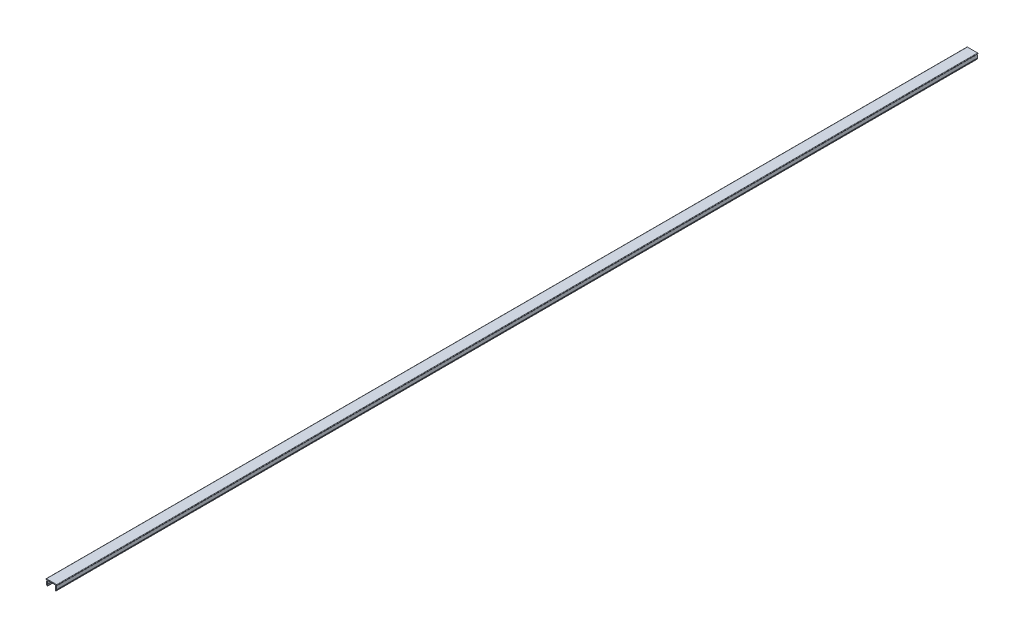
ISO-10303-21;
HEADER;
FILE_DESCRIPTION(('STEP AP214'),'2;1');
FILE_NAME('part.step','',(''),(''),'','','');
FILE_SCHEMA(('AUTOMOTIVE_DESIGN { 1 0 10303 214 1 1 1 1 }'));
ENDSEC;
DATA;
#1=APPLICATION_CONTEXT('core data for automotive mechanical design processes');
#2=APPLICATION_PROTOCOL_DEFINITION('international standard','automotive_design',2000,#1);
#3=PRODUCT_CONTEXT('',#1,'mechanical');
#4=PRODUCT('Part','Part','',(#3));
#5=PRODUCT_RELATED_PRODUCT_CATEGORY('part','',(#4));
#6=PRODUCT_DEFINITION_FORMATION('','',#4);
#7=PRODUCT_DEFINITION_CONTEXT('part definition',#1,'design');
#8=PRODUCT_DEFINITION('design','',#6,#7);
#9=PRODUCT_DEFINITION_SHAPE('','',#8);
#10=(LENGTH_UNIT() NAMED_UNIT(*) SI_UNIT(.MILLI.,.METRE.));
#11=(NAMED_UNIT(*) PLANE_ANGLE_UNIT() SI_UNIT($,.RADIAN.));
#12=(NAMED_UNIT(*) SI_UNIT($,.STERADIAN.) SOLID_ANGLE_UNIT());
#13=UNCERTAINTY_MEASURE_WITH_UNIT(LENGTH_MEASURE(1.E-05),#10,'distance_accuracy_value','');
#14=(GEOMETRIC_REPRESENTATION_CONTEXT(3) GLOBAL_UNCERTAINTY_ASSIGNED_CONTEXT((#13)) GLOBAL_UNIT_ASSIGNED_CONTEXT((#10,
#11,#12)) REPRESENTATION_CONTEXT('',''));
#15=CARTESIAN_POINT('',(0.,0.,0.));
#16=DIRECTION('',(0.,0.,1.));
#17=DIRECTION('',(1.,0.,0.));
#18=AXIS2_PLACEMENT_3D('',#15,#16,#17);
#19=CARTESIAN_POINT('',(-6.32090219434622,1.08946697437392,501.445672972466));
#20=DIRECTION('',(0.,1.,0.));
#21=DIRECTION('',(-1.,0.,0.));
#22=AXIS2_PLACEMENT_3D('',#19,#20,#21);
#23=PLANE('',#22);
#24=DIRECTION('',(1.,0.,0.));
#25=VECTOR('',#24,1.);
#26=CARTESIAN_POINT('',(-6.32090219434622,1.08946697437392,-498.554327027534));
#27=LINE('',#26,#25);
#28=CARTESIAN_POINT('',(-3.93044355146653,1.08946697437392,-498.554327027534));
#29=VERTEX_POINT('',#28);
#30=CARTESIAN_POINT('',(3.28863916277409,1.08946697437393,-498.554327027534));
#31=VERTEX_POINT('',#30);
#32=EDGE_CURVE('E202',#29,#31,#27,.T.);
#33=ORIENTED_EDGE('',*,*,#32,.T.);
#34=DIRECTION('',(0.,0.,-1.));
#35=VECTOR('',#34,1.);
#36=CARTESIAN_POINT('',(3.28863916277409,1.08946697437393,501.445672972466));
#37=LINE('',#36,#35);
#38=CARTESIAN_POINT('',(3.28863916277409,1.08946697437393,501.445672972466));
#39=VERTEX_POINT('',#38);
#40=EDGE_CURVE('E244',#31,#39,#37,.F.);
#41=ORIENTED_EDGE('',*,*,#40,.T.);
#42=DIRECTION('',(1.,0.,0.));
#43=VECTOR('',#42,1.);
#44=CARTESIAN_POINT('',(-6.32090219434622,1.08946697437392,501.445672972466));
#45=LINE('',#44,#43);
#46=CARTESIAN_POINT('',(-3.93044355146653,1.08946697437392,501.445672972466));
#47=VERTEX_POINT('',#46);
#48=EDGE_CURVE('E231',#47,#39,#45,.T.);
#49=ORIENTED_EDGE('',*,*,#48,.F.);
#50=DIRECTION('',(0.,0.,-1.));
#51=VECTOR('',#50,1.);
#52=CARTESIAN_POINT('',(-3.93044355146653,1.08946697437392,501.445672972466));
#53=LINE('',#52,#51);
#54=EDGE_CURVE('E241',#47,#29,#53,.T.);
#55=ORIENTED_EDGE('',*,*,#54,.T.);
#56=EDGE_LOOP('',(#33,#41,#49,#55));
#57=FACE_BOUND('',#56,.T.);
#58=ADVANCED_FACE('F15',(#57),#23,.F.);
#59=CARTESIAN_POINT('',(-5.82090219434622,1.08946697437392,501.445672972466));
#60=VERTEX_POINT('',#59);
#61=CARTESIAN_POINT('',(-5.38241058555351,1.08946697437392,501.445672972466));
#62=VERTEX_POINT('',#61);
#63=EDGE_CURVE('E229',#60,#62,#45,.T.);
#64=ORIENTED_EDGE('',*,*,#63,.F.);
#65=DIRECTION('',(0.,0.,-1.));
#66=VECTOR('',#65,1.);
#67=CARTESIAN_POINT('',(-5.82090219434622,1.08946697437392,-498.554327027534));
#68=LINE('',#67,#66);
#69=CARTESIAN_POINT('',(-5.82090219434622,1.08946697437392,-498.554327027534));
#70=VERTEX_POINT('',#69);
#71=EDGE_CURVE('E197',#60,#70,#68,.T.);
#72=ORIENTED_EDGE('',*,*,#71,.T.);
#73=CARTESIAN_POINT('',(-5.38241058555351,1.08946697437392,-498.554327027534));
#74=VERTEX_POINT('',#73);
#75=EDGE_CURVE('E190',#70,#74,#27,.T.);
#76=ORIENTED_EDGE('',*,*,#75,.T.);
#77=DIRECTION('',(0.,0.,-1.));
#78=VECTOR('',#77,1.);
#79=CARTESIAN_POINT('',(-5.38241058555351,1.08946697437392,501.445672972466));
#80=LINE('',#79,#78);
#81=EDGE_CURVE('E194',#62,#74,#80,.T.);
#82=ORIENTED_EDGE('',*,*,#81,.F.);
#83=EDGE_LOOP('',(#64,#72,#76,#82));
#84=FACE_BOUND('',#83,.T.);
#85=ADVANCED_FACE('F193',(#84),#23,.F.);
#86=CARTESIAN_POINT('',(4.74060619686107,1.08946697437393,-498.554327027534));
#87=VERTEX_POINT('',#86);
#88=CARTESIAN_POINT('',(5.17909780565378,1.08946697437393,-498.554327027534));
#89=VERTEX_POINT('',#88);
#90=EDGE_CURVE('E204',#87,#89,#27,.T.);
#91=ORIENTED_EDGE('',*,*,#90,.T.);
#92=DIRECTION('',(0.,0.,-1.));
#93=VECTOR('',#92,1.);
#94=CARTESIAN_POINT('',(5.17909780565378,1.08946697437393,501.445672972466));
#95=LINE('',#94,#93);
#96=CARTESIAN_POINT('',(5.17909780565378,1.08946697437393,501.445672972466));
#97=VERTEX_POINT('',#96);
#98=EDGE_CURVE('E319',#89,#97,#95,.F.);
#99=ORIENTED_EDGE('',*,*,#98,.T.);
#100=CARTESIAN_POINT('',(4.74060619686107,1.08946697437393,501.445672972466));
#101=VERTEX_POINT('',#100);
#102=EDGE_CURVE('E232',#101,#97,#45,.T.);
#103=ORIENTED_EDGE('',*,*,#102,.F.);
#104=DIRECTION('',(0.,0.,-1.));
#105=VECTOR('',#104,1.);
#106=CARTESIAN_POINT('',(4.74060619686107,1.08946697437393,501.445672972466));
#107=LINE('',#106,#105);
#108=EDGE_CURVE('E409',#101,#87,#107,.T.);
#109=ORIENTED_EDGE('',*,*,#108,.T.);
#110=EDGE_LOOP('',(#91,#99,#103,#109));
#111=FACE_BOUND('',#110,.T.);
#112=ADVANCED_FACE('F370',(#111),#23,.F.);
#113=CARTESIAN_POINT('',(-6.32090219434622,2.08946697437392,501.445672972466));
#114=DIRECTION('',(0.,1.,0.));
#115=DIRECTION('',(-1.,0.,0.));
#116=AXIS2_PLACEMENT_3D('',#113,#114,#115);
#117=PLANE('',#116);
#118=DIRECTION('',(1.,0.,0.));
#119=VECTOR('',#118,1.);
#120=CARTESIAN_POINT('',(-6.32090219434622,2.08946697437392,501.445672972466));
#121=LINE('',#120,#119);
#122=CARTESIAN_POINT('',(-5.82090219434622,2.08946697437392,501.445672972466));
#123=VERTEX_POINT('',#122);
#124=CARTESIAN_POINT('',(5.17909780565378,2.08946697437393,501.445672972466));
#125=VERTEX_POINT('',#124);
#126=EDGE_CURVE('E213',#123,#125,#121,.T.);
#127=ORIENTED_EDGE('',*,*,#126,.T.);
#128=DIRECTION('',(0.,0.,-1.));
#129=VECTOR('',#128,1.);
#130=CARTESIAN_POINT('',(5.17909780565378,2.08946697437393,501.445672972466));
#131=LINE('',#130,#129);
#132=CARTESIAN_POINT('',(5.17909780565378,2.08946697437393,-498.554327027534));
#133=VERTEX_POINT('',#132);
#134=EDGE_CURVE('E316',#125,#133,#131,.T.);
#135=ORIENTED_EDGE('',*,*,#134,.T.);
#136=DIRECTION('',(1.,0.,0.));
#137=VECTOR('',#136,1.);
#138=CARTESIAN_POINT('',(-6.32090219434622,2.08946697437392,-498.554327027534));
#139=LINE('',#138,#137);
#140=CARTESIAN_POINT('',(-5.82090219434622,2.08946697437392,-498.554327027534));
#141=VERTEX_POINT('',#140);
#142=EDGE_CURVE('E201',#141,#133,#139,.T.);
#143=ORIENTED_EDGE('',*,*,#142,.F.);
#144=DIRECTION('',(0.,0.,-1.));
#145=VECTOR('',#144,1.);
#146=CARTESIAN_POINT('',(-5.82090219434622,2.08946697437392,501.445672972466));
#147=LINE('',#146,#145);
#148=EDGE_CURVE('E313',#141,#123,#147,.F.);
#149=ORIENTED_EDGE('',*,*,#148,.T.);
#150=EDGE_LOOP('',(#127,#135,#143,#149));
#151=FACE_BOUND('',#150,.T.);
#152=ADVANCED_FACE('F358',(#151),#117,.T.);
#153=CARTESIAN_POINT('',(-4.19256356916025,-4.56053287042964,501.445672972466));
#154=DIRECTION('',(0.,0.,-1.));
#155=DIRECTION('',(-1.,0.,0.));
#156=AXIS2_PLACEMENT_3D('',#153,#154,#155);
#157=PLANE('',#156);
#158=DIRECTION('',(0.334719806751246,-0.942317701716575,0.));
#159=VECTOR('',#158,1.);
#160=CARTESIAN_POINT('',(-5.7920610452045,-2.8778929290017,501.445672972466));
#161=LINE('',#160,#159);
#162=CARTESIAN_POINT('',(-5.7920610452045,-2.8778929290017,501.445672972466));
#163=VERTEX_POINT('',#162);
#164=CARTESIAN_POINT('',(-5.39108641572947,-4.00673407814341,501.445672972466));
#165=VERTEX_POINT('',#164);
#166=EDGE_CURVE('E218',#163,#165,#161,.T.);
#167=ORIENTED_EDGE('',*,*,#166,.T.);
#168=CARTESIAN_POINT('',(-4.91992756487118,-3.83937417476779,501.445672972466));
#169=DIRECTION('',(0.,0.,-1.));
#170=DIRECTION('',(-1.,0.,0.));
#171=AXIS2_PLACEMENT_3D('',#168,#169,#170);
#172=CIRCLE('',#171,0.5);
#173=CARTESIAN_POINT('',(-4.75256766149556,-4.31053302562608,501.445672972466));
#174=VERTEX_POINT('',#173);
#175=EDGE_CURVE('E293',#165,#174,#172,.F.);
#176=ORIENTED_EDGE('',*,*,#175,.T.);
#177=CARTESIAN_POINT('',(-4.91992756487118,-3.83937417476779,501.445672972466));
#178=DIRECTION('',(0.,0.,-1.));
#179=DIRECTION('',(-1.,0.,0.));
#180=AXIS2_PLACEMENT_3D('',#177,#178,#179);
#181=CIRCLE('',#180,0.5);
#182=CARTESIAN_POINT('',(-4.4487687140129,-3.67201427139217,501.445672972466));
#183=VERTEX_POINT('',#182);
#184=EDGE_CURVE('E32',#174,#183,#181,.F.);
#185=ORIENTED_EDGE('',*,*,#184,.T.);
#186=DIRECTION('',(0.334719806751246,-0.942317701716575,0.));
#187=VECTOR('',#186,1.);
#188=CARTESIAN_POINT('',(-4.84974334348793,-2.54317312225045,501.445672972466));
#189=LINE('',#188,#187);
#190=CARTESIAN_POINT('',(-4.77188850715656,-2.76235343055475,501.445672972466));
#191=VERTEX_POINT('',#190);
#192=EDGE_CURVE('E222',#191,#183,#189,.T.);
#193=ORIENTED_EDGE('',*,*,#192,.F.);
#194=CARTESIAN_POINT('',(-4.30072965629827,-2.59499352717913,501.445672972466));
#195=DIRECTION('',(0.,0.,-1.));
#196=DIRECTION('',(-1.,0.,0.));
#197=AXIS2_PLACEMENT_3D('',#194,#195,#196);
#198=CIRCLE('',#197,0.5);
#199=CARTESIAN_POINT('',(-4.7973833464489,-2.53724309809185,501.445672972466));
#200=VERTEX_POINT('',#199);
#201=EDGE_CURVE('E9',#191,#200,#198,.T.);
#202=ORIENTED_EDGE('',*,*,#201,.T.);
#203=DIRECTION('',(-0.115500858174564,-0.993307380301254,0.));
#204=VECTOR('',#203,1.);
#205=CARTESIAN_POINT('',(-4.32424850419559,1.53171654528664,501.445672972466));
#206=LINE('',#205,#204);
#207=CARTESIAN_POINT('',(-4.42709724161715,0.647217403461206,501.445672972466));
#208=VERTEX_POINT('',#207);
#209=EDGE_CURVE('E413',#208,#200,#206,.T.);
#210=ORIENTED_EDGE('',*,*,#209,.F.);
#211=CARTESIAN_POINT('',(-3.93044355146653,0.589466974373924,501.445672972466));
#212=DIRECTION('',(0.,0.,-1.));
#213=DIRECTION('',(-1.,0.,0.));
#214=AXIS2_PLACEMENT_3D('',#211,#212,#213);
#215=CIRCLE('',#214,0.5);
#216=EDGE_CURVE('E328',#208,#47,#215,.T.);
#217=ORIENTED_EDGE('',*,*,#216,.T.);
#218=ORIENTED_EDGE('',*,*,#48,.T.);
#219=CARTESIAN_POINT('',(3.28863916277409,0.589466974373926,501.445672972466));
#220=DIRECTION('',(0.,0.,-1.));
#221=DIRECTION('',(-1.,0.,0.));
#222=AXIS2_PLACEMENT_3D('',#219,#220,#221);
#223=CIRCLE('',#222,0.5);
#224=CARTESIAN_POINT('',(3.78529285292472,0.647217403461207,501.445672972466));
#225=VERTEX_POINT('',#224);
#226=EDGE_CURVE('E324',#39,#225,#223,.T.);
#227=ORIENTED_EDGE('',*,*,#226,.T.);
#228=DIRECTION('',(0.115500858174564,-0.993307380301254,0.));
#229=VECTOR('',#228,1.);
#230=CARTESIAN_POINT('',(3.68244411550316,1.53171654528664,501.445672972466));
#231=LINE('',#230,#229);
#232=CARTESIAN_POINT('',(4.15557895775647,-2.53724309809185,501.445672972466));
#233=VERTEX_POINT('',#232);
#234=EDGE_CURVE('E394',#225,#233,#231,.T.);
#235=ORIENTED_EDGE('',*,*,#234,.T.);
#236=CARTESIAN_POINT('',(3.65892526760584,-2.59499352717913,501.445672972466));
#237=DIRECTION('',(0.,0.,-1.));
#238=DIRECTION('',(-1.,0.,0.));
#239=AXIS2_PLACEMENT_3D('',#236,#237,#238);
#240=CIRCLE('',#239,0.5);
#241=CARTESIAN_POINT('',(4.13008411846413,-2.76235343055475,501.445672972466));
#242=VERTEX_POINT('',#241);
#243=EDGE_CURVE('E332',#233,#242,#240,.T.);
#244=ORIENTED_EDGE('',*,*,#243,.T.);
#245=DIRECTION('',(-0.334719806751245,-0.942317701716576,0.));
#246=VECTOR('',#245,1.);
#247=CARTESIAN_POINT('',(4.2079389547955,-2.54317312225045,501.445672972466));
#248=LINE('',#247,#246);
#249=CARTESIAN_POINT('',(3.80696432532046,-3.67201427139216,501.445672972466));
#250=VERTEX_POINT('',#249);
#251=EDGE_CURVE('E398',#242,#250,#248,.T.);
#252=ORIENTED_EDGE('',*,*,#251,.T.);
#253=CARTESIAN_POINT('',(4.27812317617875,-3.83937417476779,501.445672972466));
#254=DIRECTION('',(0.,0.,-1.));
#255=DIRECTION('',(-1.,0.,0.));
#256=AXIS2_PLACEMENT_3D('',#253,#254,#255);
#257=CIRCLE('',#256,0.5);
#258=CARTESIAN_POINT('',(4.11076327280313,-4.31053302562608,501.445672972466));
#259=VERTEX_POINT('',#258);
#260=EDGE_CURVE('E288',#250,#259,#257,.F.);
#261=ORIENTED_EDGE('',*,*,#260,.T.);
#262=CARTESIAN_POINT('',(4.27812317617875,-3.83937417476779,501.445672972466));
#263=DIRECTION('',(0.,0.,-1.));
#264=DIRECTION('',(-1.,0.,0.));
#265=AXIS2_PLACEMENT_3D('',#262,#263,#264);
#266=CIRCLE('',#265,0.5);
#267=CARTESIAN_POINT('',(4.74928202703704,-4.00673407814341,501.445672972466));
#268=VERTEX_POINT('',#267);
#269=EDGE_CURVE('E290',#259,#268,#266,.F.);
#270=ORIENTED_EDGE('',*,*,#269,.T.);
#271=DIRECTION('',(-0.334719806751245,-0.942317701716576,0.));
#272=VECTOR('',#271,1.);
#273=CARTESIAN_POINT('',(5.15025665651207,-2.8778929290017,501.445672972466));
#274=LINE('',#273,#272);
#275=CARTESIAN_POINT('',(5.15025665651207,-2.8778929290017,501.445672972466));
#276=VERTEX_POINT('',#275);
#277=EDGE_CURVE('E402',#276,#268,#274,.T.);
#278=ORIENTED_EDGE('',*,*,#277,.F.);
#279=CARTESIAN_POINT('',(4.67909780565378,-2.71053302562608,501.445672972466));
#280=DIRECTION('',(0.,0.,-1.));
#281=DIRECTION('',(-1.,0.,0.));
#282=AXIS2_PLACEMENT_3D('',#279,#280,#281);
#283=CIRCLE('',#282,0.5);
#284=CARTESIAN_POINT('',(5.17575149580441,-2.65278259653879,501.445672972466));
#285=VERTEX_POINT('',#284);
#286=EDGE_CURVE('E284',#276,#285,#283,.F.);
#287=ORIENTED_EDGE('',*,*,#286,.T.);
#288=DIRECTION('',(0.115500858174564,-0.993307380301254,0.));
#289=VECTOR('',#288,1.);
#290=CARTESIAN_POINT('',(4.67575149580441,1.64721740346121,501.445672972466));
#291=LINE('',#290,#289);
#292=EDGE_CURVE('E374',#101,#285,#291,.T.);
#293=ORIENTED_EDGE('',*,*,#292,.F.);
#294=ORIENTED_EDGE('',*,*,#102,.T.);
#295=CARTESIAN_POINT('',(5.17909780565378,1.58946697437393,501.445672972466));
#296=DIRECTION('',(0.,0.,-1.));
#297=DIRECTION('',(-1.,0.,0.));
#298=AXIS2_PLACEMENT_3D('',#295,#296,#297);
#299=CIRCLE('',#298,0.5);
#300=CARTESIAN_POINT('',(5.67909780565378,1.58946697437393,501.445672972466));
#301=VERTEX_POINT('',#300);
#302=EDGE_CURVE('E280',#97,#301,#299,.F.);
#303=ORIENTED_EDGE('',*,*,#302,.T.);
#304=CARTESIAN_POINT('',(5.17909780565378,1.58946697437392,501.445672972466));
#305=DIRECTION('',(0.,0.,-1.));
#306=DIRECTION('',(-1.,0.,0.));
#307=AXIS2_PLACEMENT_3D('',#304,#305,#306);
#308=CIRCLE('',#307,0.5);
#309=EDGE_CURVE('E282',#301,#125,#308,.F.);
#310=ORIENTED_EDGE('',*,*,#309,.T.);
#311=ORIENTED_EDGE('',*,*,#126,.F.);
#312=CARTESIAN_POINT('',(-5.82090219434622,1.58946697437392,501.445672972466));
#313=DIRECTION('',(0.,0.,-1.));
#314=DIRECTION('',(-1.,0.,0.));
#315=AXIS2_PLACEMENT_3D('',#312,#313,#314);
#316=CIRCLE('',#315,0.5);
#317=CARTESIAN_POINT('',(-6.32090219434622,1.58946697437392,501.445672972466));
#318=VERTEX_POINT('',#317);
#319=EDGE_CURVE('E278',#123,#318,#316,.F.);
#320=ORIENTED_EDGE('',*,*,#319,.T.);
#321=CARTESIAN_POINT('',(-5.82090219434622,1.58946697437392,501.445672972466));
#322=DIRECTION('',(0.,0.,-1.));
#323=DIRECTION('',(-1.,0.,0.));
#324=AXIS2_PLACEMENT_3D('',#321,#322,#323);
#325=CIRCLE('',#324,0.5);
#326=EDGE_CURVE('E276',#318,#60,#325,.F.);
#327=ORIENTED_EDGE('',*,*,#326,.T.);
#328=ORIENTED_EDGE('',*,*,#63,.T.);
#329=DIRECTION('',(-0.115500858174564,-0.993307380301254,0.));
#330=VECTOR('',#329,1.);
#331=CARTESIAN_POINT('',(-5.31755588449685,1.6472174034612,501.445672972466));
#332=LINE('',#331,#330);
#333=CARTESIAN_POINT('',(-5.81755588449684,-2.6527825965388,501.445672972466));
#334=VERTEX_POINT('',#333);
#335=EDGE_CURVE('E211',#62,#334,#332,.T.);
#336=ORIENTED_EDGE('',*,*,#335,.T.);
#337=CARTESIAN_POINT('',(-5.32090219434622,-2.71053302562608,501.445672972466));
#338=DIRECTION('',(0.,0.,-1.));
#339=DIRECTION('',(-1.,0.,0.));
#340=AXIS2_PLACEMENT_3D('',#337,#338,#339);
#341=CIRCLE('',#340,0.5);
#342=EDGE_CURVE('E286',#334,#163,#341,.F.);
#343=ORIENTED_EDGE('',*,*,#342,.T.);
#344=EDGE_LOOP('',(#167,#176,#185,#193,#202,#210,#217,#218,#227,#235,#244,#252,#261,#270,#278,
#287,#293,#294,#303,#310,#311,#320,#327,#328,#336,#343));
#345=FACE_BOUND('',#344,.T.);
#346=ADVANCED_FACE('F354',(#345),#157,.F.);
#347=CARTESIAN_POINT('',(-4.19256356916025,-4.56053287042964,-498.554327027534));
#348=DIRECTION('',(0.,0.,-1.));
#349=DIRECTION('',(-1.,0.,0.));
#350=AXIS2_PLACEMENT_3D('',#347,#348,#349);
#351=PLANE('',#350);
#352=CARTESIAN_POINT('',(-4.91992756487118,-3.83937417476779,-498.554327027534));
#353=DIRECTION('',(0.,0.,-1.));
#354=DIRECTION('',(-1.,0.,0.));
#355=AXIS2_PLACEMENT_3D('',#352,#353,#354);
#356=CIRCLE('',#355,0.5);
#357=CARTESIAN_POINT('',(-4.4487687140129,-3.67201427139217,-498.554327027534));
#358=VERTEX_POINT('',#357);
#359=CARTESIAN_POINT('',(-4.75256766149556,-4.31053302562608,-498.554327027534));
#360=VERTEX_POINT('',#359);
#361=EDGE_CURVE('E266',#358,#360,#356,.T.);
#362=ORIENTED_EDGE('',*,*,#361,.T.);
#363=CARTESIAN_POINT('',(-4.91992756487118,-3.83937417476779,-498.554327027534));
#364=DIRECTION('',(0.,0.,-1.));
#365=DIRECTION('',(-1.,0.,0.));
#366=AXIS2_PLACEMENT_3D('',#363,#364,#365);
#367=CIRCLE('',#366,0.5);
#368=CARTESIAN_POINT('',(-5.39108641572947,-4.00673407814341,-498.554327027534));
#369=VERTEX_POINT('',#368);
#370=EDGE_CURVE('E268',#360,#369,#367,.T.);
#371=ORIENTED_EDGE('',*,*,#370,.T.);
#372=DIRECTION('',(0.334719806751246,-0.942317701716575,0.));
#373=VECTOR('',#372,1.);
#374=CARTESIAN_POINT('',(-5.7920610452045,-2.8778929290017,-498.554327027534));
#375=LINE('',#374,#373);
#376=CARTESIAN_POINT('',(-5.7920610452045,-2.8778929290017,-498.554327027534));
#377=VERTEX_POINT('',#376);
#378=EDGE_CURVE('E410',#377,#369,#375,.T.);
#379=ORIENTED_EDGE('',*,*,#378,.F.);
#380=CARTESIAN_POINT('',(-5.32090219434622,-2.71053302562608,-498.554327027534));
#381=DIRECTION('',(0.,0.,-1.));
#382=DIRECTION('',(-1.,0.,0.));
#383=AXIS2_PLACEMENT_3D('',#380,#381,#382);
#384=CIRCLE('',#383,0.5);
#385=CARTESIAN_POINT('',(-5.81755588449684,-2.6527825965388,-498.554327027534));
#386=VERTEX_POINT('',#385);
#387=EDGE_CURVE('E217',#377,#386,#384,.T.);
#388=ORIENTED_EDGE('',*,*,#387,.T.);
#389=DIRECTION('',(-0.115500858174564,-0.993307380301254,0.));
#390=VECTOR('',#389,1.);
#391=CARTESIAN_POINT('',(-5.31755588449685,1.6472174034612,-498.554327027534));
#392=LINE('',#391,#390);
#393=EDGE_CURVE('E208',#74,#386,#392,.T.);
#394=ORIENTED_EDGE('',*,*,#393,.F.);
#395=ORIENTED_EDGE('',*,*,#75,.F.);
#396=CARTESIAN_POINT('',(-5.82090219434622,1.58946697437392,-498.554327027534));
#397=DIRECTION('',(0.,0.,-1.));
#398=DIRECTION('',(-1.,0.,0.));
#399=AXIS2_PLACEMENT_3D('',#396,#397,#398);
#400=CIRCLE('',#399,0.5);
#401=CARTESIAN_POINT('',(-6.32090219434622,1.58946697437392,-498.554327027534));
#402=VERTEX_POINT('',#401);
#403=EDGE_CURVE('E251',#70,#402,#400,.T.);
#404=ORIENTED_EDGE('',*,*,#403,.T.);
#405=CARTESIAN_POINT('',(-5.82090219434622,1.58946697437392,-498.554327027534));
#406=DIRECTION('',(0.,0.,-1.));
#407=DIRECTION('',(-1.,0.,0.));
#408=AXIS2_PLACEMENT_3D('',#405,#406,#407);
#409=CIRCLE('',#408,0.5);
#410=EDGE_CURVE('E253',#402,#141,#409,.T.);
#411=ORIENTED_EDGE('',*,*,#410,.T.);
#412=ORIENTED_EDGE('',*,*,#142,.T.);
#413=CARTESIAN_POINT('',(5.17909780565378,1.58946697437392,-498.554327027534));
#414=DIRECTION('',(0.,0.,-1.));
#415=DIRECTION('',(-1.,0.,0.));
#416=AXIS2_PLACEMENT_3D('',#413,#414,#415);
#417=CIRCLE('',#416,0.5);
#418=CARTESIAN_POINT('',(5.67909780565378,1.58946697437393,-498.554327027534));
#419=VERTEX_POINT('',#418);
#420=EDGE_CURVE('E257',#133,#419,#417,.T.);
#421=ORIENTED_EDGE('',*,*,#420,.T.);
#422=CARTESIAN_POINT('',(5.17909780565378,1.58946697437393,-498.554327027534));
#423=DIRECTION('',(0.,0.,-1.));
#424=DIRECTION('',(-1.,0.,0.));
#425=AXIS2_PLACEMENT_3D('',#422,#423,#424);
#426=CIRCLE('',#425,0.5);
#427=EDGE_CURVE('E255',#419,#89,#426,.T.);
#428=ORIENTED_EDGE('',*,*,#427,.T.);
#429=ORIENTED_EDGE('',*,*,#90,.F.);
#430=DIRECTION('',(0.115500858174564,-0.993307380301254,0.));
#431=VECTOR('',#430,1.);
#432=CARTESIAN_POINT('',(4.67575149580441,1.64721740346121,-498.554327027534));
#433=LINE('',#432,#431);
#434=CARTESIAN_POINT('',(5.17575149580441,-2.65278259653879,-498.554327027534));
#435=VERTEX_POINT('',#434);
#436=EDGE_CURVE('E399',#87,#435,#433,.T.);
#437=ORIENTED_EDGE('',*,*,#436,.T.);
#438=CARTESIAN_POINT('',(4.67909780565378,-2.71053302562608,-498.554327027534));
#439=DIRECTION('',(0.,0.,-1.));
#440=DIRECTION('',(-1.,0.,0.));
#441=AXIS2_PLACEMENT_3D('',#438,#439,#440);
#442=CIRCLE('',#441,0.5);
#443=CARTESIAN_POINT('',(5.15025665651207,-2.8778929290017,-498.554327027534));
#444=VERTEX_POINT('',#443);
#445=EDGE_CURVE('E259',#435,#444,#442,.T.);
#446=ORIENTED_EDGE('',*,*,#445,.T.);
#447=DIRECTION('',(-0.334719806751245,-0.942317701716576,0.));
#448=VECTOR('',#447,1.);
#449=CARTESIAN_POINT('',(5.15025665651207,-2.8778929290017,-498.554327027534));
#450=LINE('',#449,#448);
#451=CARTESIAN_POINT('',(4.74928202703704,-4.00673407814341,-498.554327027534));
#452=VERTEX_POINT('',#451);
#453=EDGE_CURVE('E405',#444,#452,#450,.T.);
#454=ORIENTED_EDGE('',*,*,#453,.T.);
#455=CARTESIAN_POINT('',(4.27812317617875,-3.83937417476779,-498.554327027534));
#456=DIRECTION('',(0.,0.,-1.));
#457=DIRECTION('',(-1.,0.,0.));
#458=AXIS2_PLACEMENT_3D('',#455,#456,#457);
#459=CIRCLE('',#458,0.5);
#460=CARTESIAN_POINT('',(4.11076327280313,-4.31053302562608,-498.554327027534));
#461=VERTEX_POINT('',#460);
#462=EDGE_CURVE('E264',#452,#461,#459,.T.);
#463=ORIENTED_EDGE('',*,*,#462,.T.);
#464=CARTESIAN_POINT('',(4.27812317617875,-3.83937417476779,-498.554327027534));
#465=DIRECTION('',(0.,0.,-1.));
#466=DIRECTION('',(-1.,0.,0.));
#467=AXIS2_PLACEMENT_3D('',#464,#465,#466);
#468=CIRCLE('',#467,0.5);
#469=CARTESIAN_POINT('',(3.80696432532046,-3.67201427139216,-498.554327027534));
#470=VERTEX_POINT('',#469);
#471=EDGE_CURVE('E262',#461,#470,#468,.T.);
#472=ORIENTED_EDGE('',*,*,#471,.T.);
#473=DIRECTION('',(-0.334719806751245,-0.942317701716576,0.));
#474=VECTOR('',#473,1.);
#475=CARTESIAN_POINT('',(4.2079389547955,-2.54317312225045,-498.554327027534));
#476=LINE('',#475,#474);
#477=CARTESIAN_POINT('',(4.13008411846413,-2.76235343055475,-498.554327027534));
#478=VERTEX_POINT('',#477);
#479=EDGE_CURVE('E338',#478,#470,#476,.T.);
#480=ORIENTED_EDGE('',*,*,#479,.F.);
#481=CARTESIAN_POINT('',(3.65892526760584,-2.59499352717913,-498.554327027534));
#482=DIRECTION('',(0.,0.,-1.));
#483=DIRECTION('',(-1.,0.,0.));
#484=AXIS2_PLACEMENT_3D('',#481,#482,#483);
#485=CIRCLE('',#484,0.5);
#486=CARTESIAN_POINT('',(4.15557895775647,-2.53724309809185,-498.554327027534));
#487=VERTEX_POINT('',#486);
#488=EDGE_CURVE('E330',#478,#487,#485,.F.);
#489=ORIENTED_EDGE('',*,*,#488,.T.);
#490=DIRECTION('',(0.115500858174564,-0.993307380301254,0.));
#491=VECTOR('',#490,1.);
#492=CARTESIAN_POINT('',(3.68244411550316,1.53171654528664,-498.554327027534));
#493=LINE('',#492,#491);
#494=CARTESIAN_POINT('',(3.78529285292472,0.647217403461207,-498.554327027534));
#495=VERTEX_POINT('',#494);
#496=EDGE_CURVE('E392',#495,#487,#493,.T.);
#497=ORIENTED_EDGE('',*,*,#496,.F.);
#498=CARTESIAN_POINT('',(3.28863916277409,0.589466974373926,-498.554327027534));
#499=DIRECTION('',(0.,0.,-1.));
#500=DIRECTION('',(-1.,0.,0.));
#501=AXIS2_PLACEMENT_3D('',#498,#499,#500);
#502=CIRCLE('',#501,0.5);
#503=EDGE_CURVE('E322',#495,#31,#502,.F.);
#504=ORIENTED_EDGE('',*,*,#503,.T.);
#505=ORIENTED_EDGE('',*,*,#32,.F.);
#506=CARTESIAN_POINT('',(-3.93044355146653,0.589466974373924,-498.554327027534));
#507=DIRECTION('',(0.,0.,-1.));
#508=DIRECTION('',(-1.,0.,0.));
#509=AXIS2_PLACEMENT_3D('',#506,#507,#508);
#510=CIRCLE('',#509,0.5);
#511=CARTESIAN_POINT('',(-4.42709724161715,0.647217403461206,-498.554327027534));
#512=VERTEX_POINT('',#511);
#513=EDGE_CURVE('E326',#29,#512,#510,.F.);
#514=ORIENTED_EDGE('',*,*,#513,.T.);
#515=DIRECTION('',(-0.115500858174564,-0.993307380301254,0.));
#516=VECTOR('',#515,1.);
#517=CARTESIAN_POINT('',(-4.32424850419559,1.53171654528664,-498.554327027534));
#518=LINE('',#517,#516);
#519=CARTESIAN_POINT('',(-4.7973833464489,-2.53724309809185,-498.554327027534));
#520=VERTEX_POINT('',#519);
#521=EDGE_CURVE('E219',#512,#520,#518,.T.);
#522=ORIENTED_EDGE('',*,*,#521,.T.);
#523=CARTESIAN_POINT('',(-4.30072965629827,-2.59499352717913,-498.554327027534));
#524=DIRECTION('',(0.,0.,-1.));
#525=DIRECTION('',(-1.,0.,0.));
#526=AXIS2_PLACEMENT_3D('',#523,#524,#525);
#527=CIRCLE('',#526,0.5);
#528=CARTESIAN_POINT('',(-4.77188850715656,-2.76235343055475,-498.554327027534));
#529=VERTEX_POINT('',#528);
#530=EDGE_CURVE('E24',#520,#529,#527,.F.);
#531=ORIENTED_EDGE('',*,*,#530,.T.);
#532=DIRECTION('',(0.334719806751246,-0.942317701716575,0.));
#533=VECTOR('',#532,1.);
#534=CARTESIAN_POINT('',(-4.84974334348793,-2.54317312225045,-498.554327027534));
#535=LINE('',#534,#533);
#536=EDGE_CURVE('E225',#529,#358,#535,.T.);
#537=ORIENTED_EDGE('',*,*,#536,.T.);
#538=EDGE_LOOP('',(#362,#371,#379,#388,#394,#395,#404,#411,#412,#421,#428,#429,#437,#446,#454,
#463,#472,#480,#489,#497,#504,#505,#514,#522,#531,#537));
#539=FACE_BOUND('',#538,.T.);
#540=ADVANCED_FACE('F215',(#539),#351,.T.);
#541=CARTESIAN_POINT('',(-4.32424850419559,1.53171654528664,501.445672972466));
#542=DIRECTION('',(0.993307380301254,-0.115500858174564,0.));
#543=DIRECTION('',(0.115500858174564,0.993307380301254,0.));
#544=AXIS2_PLACEMENT_3D('',#541,#542,#543);
#545=PLANE('',#544);
#546=ORIENTED_EDGE('',*,*,#521,.F.);
#547=DIRECTION('',(0.,0.,-1.));
#548=VECTOR('',#547,1.);
#549=CARTESIAN_POINT('',(-4.42709724161715,0.647217403461206,501.445672972466));
#550=LINE('',#549,#548);
#551=EDGE_CURVE('E249',#512,#208,#550,.F.);
#552=ORIENTED_EDGE('',*,*,#551,.T.);
#553=ORIENTED_EDGE('',*,*,#209,.T.);
#554=DIRECTION('',(0.,0.,-1.));
#555=VECTOR('',#554,1.);
#556=CARTESIAN_POINT('',(-4.7973833464489,-2.53724309809185,-498.554327027534));
#557=LINE('',#556,#555);
#558=EDGE_CURVE('E246',#200,#520,#557,.T.);
#559=ORIENTED_EDGE('',*,*,#558,.T.);
#560=EDGE_LOOP('',(#546,#552,#553,#559));
#561=FACE_BOUND('',#560,.T.);
#562=ADVANCED_FACE('F466',(#561),#545,.T.);
#563=CARTESIAN_POINT('',(-5.31755588449685,1.6472174034612,501.445672972466));
#564=DIRECTION('',(0.993307380301254,-0.115500858174564,0.));
#565=DIRECTION('',(0.115500858174564,0.993307380301254,0.));
#566=AXIS2_PLACEMENT_3D('',#563,#564,#565);
#567=PLANE('',#566);
#568=ORIENTED_EDGE('',*,*,#393,.T.);
#569=DIRECTION('',(0.,0.,-1.));
#570=VECTOR('',#569,1.);
#571=CARTESIAN_POINT('',(-5.81755588449684,-2.6527825965388,501.445672972466));
#572=LINE('',#571,#570);
#573=EDGE_CURVE('E308',#386,#334,#572,.F.);
#574=ORIENTED_EDGE('',*,*,#573,.T.);
#575=ORIENTED_EDGE('',*,*,#335,.F.);
#576=ORIENTED_EDGE('',*,*,#81,.T.);
#577=EDGE_LOOP('',(#568,#574,#575,#576));
#578=FACE_BOUND('',#577,.T.);
#579=ADVANCED_FACE('F207',(#578),#567,.F.);
#580=CARTESIAN_POINT('',(-5.7920610452045,-2.8778929290017,501.445672972466));
#581=DIRECTION('',(0.942317701716575,0.334719806751246,0.));
#582=DIRECTION('',(-0.334719806751246,0.942317701716575,0.));
#583=AXIS2_PLACEMENT_3D('',#580,#581,#582);
#584=PLANE('',#583);
#585=ORIENTED_EDGE('',*,*,#378,.T.);
#586=DIRECTION('',(0.,0.,-1.));
#587=VECTOR('',#586,1.);
#588=CARTESIAN_POINT('',(-5.39108641572947,-4.00673407814341,501.445672972466));
#589=LINE('',#588,#587);
#590=EDGE_CURVE('E273',#369,#165,#589,.F.);
#591=ORIENTED_EDGE('',*,*,#590,.T.);
#592=ORIENTED_EDGE('',*,*,#166,.F.);
#593=DIRECTION('',(0.,0.,-1.));
#594=VECTOR('',#593,1.);
#595=CARTESIAN_POINT('',(-5.7920610452045,-2.8778929290017,501.445672972466));
#596=LINE('',#595,#594);
#597=EDGE_CURVE('E270',#163,#377,#596,.T.);
#598=ORIENTED_EDGE('',*,*,#597,.T.);
#599=EDGE_LOOP('',(#585,#591,#592,#598));
#600=FACE_BOUND('',#599,.T.);
#601=ADVANCED_FACE('F429',(#600),#584,.F.);
#602=CARTESIAN_POINT('',(-4.84974334348793,-2.54317312225045,501.445672972466));
#603=DIRECTION('',(0.942317701716575,0.334719806751246,0.));
#604=DIRECTION('',(-0.334719806751246,0.942317701716575,0.));
#605=AXIS2_PLACEMENT_3D('',#602,#603,#604);
#606=PLANE('',#605);
#607=ORIENTED_EDGE('',*,*,#192,.T.);
#608=DIRECTION('',(0.,0.,-1.));
#609=VECTOR('',#608,1.);
#610=CARTESIAN_POINT('',(-4.4487687140129,-3.67201427139217,501.445672972466));
#611=LINE('',#610,#609);
#612=EDGE_CURVE('E296',#183,#358,#611,.T.);
#613=ORIENTED_EDGE('',*,*,#612,.T.);
#614=ORIENTED_EDGE('',*,*,#536,.F.);
#615=DIRECTION('',(0.,0.,-1.));
#616=VECTOR('',#615,1.);
#617=CARTESIAN_POINT('',(-4.77188850715656,-2.76235343055475,501.445672972466));
#618=LINE('',#617,#616);
#619=EDGE_CURVE('E39',#529,#191,#618,.F.);
#620=ORIENTED_EDGE('',*,*,#619,.T.);
#621=EDGE_LOOP('',(#607,#613,#614,#620));
#622=FACE_BOUND('',#621,.T.);
#623=ADVANCED_FACE('F470',(#622),#606,.T.);
#624=CARTESIAN_POINT('',(4.67575149580441,1.64721740346121,501.445672972466));
#625=DIRECTION('',(0.993307380301254,0.115500858174564,0.));
#626=DIRECTION('',(-0.115500858174564,0.993307380301254,0.));
#627=AXIS2_PLACEMENT_3D('',#624,#625,#626);
#628=PLANE('',#627);
#629=ORIENTED_EDGE('',*,*,#292,.T.);
#630=DIRECTION('',(0.,0.,-1.));
#631=VECTOR('',#630,1.);
#632=CARTESIAN_POINT('',(5.17575149580441,-2.6527825965388,501.445672972466));
#633=LINE('',#632,#631);
#634=EDGE_CURVE('E310',#285,#435,#633,.T.);
#635=ORIENTED_EDGE('',*,*,#634,.T.);
#636=ORIENTED_EDGE('',*,*,#436,.F.);
#637=ORIENTED_EDGE('',*,*,#108,.F.);
#638=EDGE_LOOP('',(#629,#635,#636,#637));
#639=FACE_BOUND('',#638,.T.);
#640=ADVANCED_FACE('F473',(#639),#628,.T.);
#641=CARTESIAN_POINT('',(3.68244411550316,1.53171654528664,501.445672972466));
#642=DIRECTION('',(0.993307380301254,0.115500858174564,0.));
#643=DIRECTION('',(-0.115500858174564,0.993307380301254,0.));
#644=AXIS2_PLACEMENT_3D('',#641,#642,#643);
#645=PLANE('',#644);
#646=ORIENTED_EDGE('',*,*,#234,.F.);
#647=DIRECTION('',(0.,0.,-1.));
#648=VECTOR('',#647,1.);
#649=CARTESIAN_POINT('',(3.78529285292472,0.647217403461207,-498.554327027534));
#650=LINE('',#649,#648);
#651=EDGE_CURVE('E238',#225,#495,#650,.T.);
#652=ORIENTED_EDGE('',*,*,#651,.T.);
#653=ORIENTED_EDGE('',*,*,#496,.T.);
#654=DIRECTION('',(0.,0.,-1.));
#655=VECTOR('',#654,1.);
#656=CARTESIAN_POINT('',(4.15557895775647,-2.53724309809185,501.445672972466));
#657=LINE('',#656,#655);
#658=EDGE_CURVE('E212',#487,#233,#657,.F.);
#659=ORIENTED_EDGE('',*,*,#658,.T.);
#660=EDGE_LOOP('',(#646,#652,#653,#659));
#661=FACE_BOUND('',#660,.T.);
#662=ADVANCED_FACE('F391',(#661),#645,.F.);
#663=CARTESIAN_POINT('',(4.2079389547955,-2.54317312225045,501.445672972466));
#664=DIRECTION('',(0.942317701716576,-0.334719806751245,0.));
#665=DIRECTION('',(0.334719806751245,0.942317701716576,0.));
#666=AXIS2_PLACEMENT_3D('',#663,#664,#665);
#667=PLANE('',#666);
#668=ORIENTED_EDGE('',*,*,#479,.T.);
#669=DIRECTION('',(0.,0.,-1.));
#670=VECTOR('',#669,1.);
#671=CARTESIAN_POINT('',(3.80696432532046,-3.67201427139216,501.445672972466));
#672=LINE('',#671,#670);
#673=EDGE_CURVE('E306',#470,#250,#672,.F.);
#674=ORIENTED_EDGE('',*,*,#673,.T.);
#675=ORIENTED_EDGE('',*,*,#251,.F.);
#676=DIRECTION('',(0.,0.,-1.));
#677=VECTOR('',#676,1.);
#678=CARTESIAN_POINT('',(4.13008411846413,-2.76235343055475,-498.554327027534));
#679=LINE('',#678,#677);
#680=EDGE_CURVE('E303',#242,#478,#679,.T.);
#681=ORIENTED_EDGE('',*,*,#680,.T.);
#682=EDGE_LOOP('',(#668,#674,#675,#681));
#683=FACE_BOUND('',#682,.T.);
#684=ADVANCED_FACE('F479',(#683),#667,.F.);
#685=CARTESIAN_POINT('',(5.15025665651207,-2.8778929290017,501.445672972466));
#686=DIRECTION('',(0.942317701716576,-0.334719806751245,0.));
#687=DIRECTION('',(0.334719806751245,0.942317701716576,0.));
#688=AXIS2_PLACEMENT_3D('',#685,#686,#687);
#689=PLANE('',#688);
#690=ORIENTED_EDGE('',*,*,#277,.T.);
#691=DIRECTION('',(0.,0.,-1.));
#692=VECTOR('',#691,1.);
#693=CARTESIAN_POINT('',(4.74928202703704,-4.00673407814341,501.445672972466));
#694=LINE('',#693,#692);
#695=EDGE_CURVE('E300',#268,#452,#694,.T.);
#696=ORIENTED_EDGE('',*,*,#695,.T.);
#697=ORIENTED_EDGE('',*,*,#453,.F.);
#698=DIRECTION('',(0.,0.,-1.));
#699=VECTOR('',#698,1.);
#700=CARTESIAN_POINT('',(5.15025665651207,-2.8778929290017,501.445672972466));
#701=LINE('',#700,#699);
#702=EDGE_CURVE('E298',#444,#276,#701,.F.);
#703=ORIENTED_EDGE('',*,*,#702,.T.);
#704=EDGE_LOOP('',(#690,#696,#697,#703));
#705=FACE_BOUND('',#704,.T.);
#706=ADVANCED_FACE('F482',(#705),#689,.T.);
#707=CARTESIAN_POINT('',(3.28863916277409,0.589466974373926,501.445672972466));
#708=DIRECTION('',(0.,0.,1.));
#709=DIRECTION('',(1.,0.,0.));
#710=AXIS2_PLACEMENT_3D('',#707,#708,#709);
#711=CYLINDRICAL_SURFACE('',#710,0.5);
#712=ORIENTED_EDGE('',*,*,#226,.F.);
#713=ORIENTED_EDGE('',*,*,#40,.F.);
#714=ORIENTED_EDGE('',*,*,#503,.F.);
#715=ORIENTED_EDGE('',*,*,#651,.F.);
#716=EDGE_LOOP('',(#712,#713,#714,#715));
#717=FACE_BOUND('',#716,.T.);
#718=ADVANCED_FACE('F387',(#717),#711,.F.);
#719=CARTESIAN_POINT('',(-3.93044355146653,0.589466974373924,501.445672972466));
#720=DIRECTION('',(0.,0.,-1.));
#721=DIRECTION('',(-1.,0.,0.));
#722=AXIS2_PLACEMENT_3D('',#719,#720,#721);
#723=CYLINDRICAL_SURFACE('',#722,0.5);
#724=ORIENTED_EDGE('',*,*,#216,.F.);
#725=ORIENTED_EDGE('',*,*,#551,.F.);
#726=ORIENTED_EDGE('',*,*,#513,.F.);
#727=ORIENTED_EDGE('',*,*,#54,.F.);
#728=EDGE_LOOP('',(#724,#725,#726,#727));
#729=FACE_BOUND('',#728,.T.);
#730=ADVANCED_FACE('F511',(#729),#723,.F.);
#731=CARTESIAN_POINT('',(-4.91992756487118,-3.83937417476779,501.445672972466));
#732=DIRECTION('',(0.,0.,-1.));
#733=DIRECTION('',(-1.,0.,0.));
#734=AXIS2_PLACEMENT_3D('',#731,#732,#733);
#735=CYLINDRICAL_SURFACE('',#734,0.5);
#736=ORIENTED_EDGE('',*,*,#612,.F.);
#737=ORIENTED_EDGE('',*,*,#184,.F.);
#738=DIRECTION('',(0.,0.,-1.));
#739=VECTOR('',#738,1.);
#740=CARTESIAN_POINT('',(-4.75256766149556,-4.31053302562608,501.445672972466));
#741=LINE('',#740,#739);
#742=EDGE_CURVE('E335',#360,#174,#741,.F.);
#743=ORIENTED_EDGE('',*,*,#742,.F.);
#744=ORIENTED_EDGE('',*,*,#361,.F.);
#745=EDGE_LOOP('',(#736,#737,#743,#744));
#746=FACE_BOUND('',#745,.T.);
#747=ADVANCED_FACE('F423',(#746),#735,.T.);
#748=CARTESIAN_POINT('',(-4.91992756487118,-3.83937417476779,501.445672972466));
#749=DIRECTION('',(0.,0.,1.));
#750=DIRECTION('',(1.,0.,0.));
#751=AXIS2_PLACEMENT_3D('',#748,#749,#750);
#752=CYLINDRICAL_SURFACE('',#751,0.5);
#753=ORIENTED_EDGE('',*,*,#175,.F.);
#754=ORIENTED_EDGE('',*,*,#590,.F.);
#755=ORIENTED_EDGE('',*,*,#370,.F.);
#756=ORIENTED_EDGE('',*,*,#742,.T.);
#757=EDGE_LOOP('',(#753,#754,#755,#756));
#758=FACE_BOUND('',#757,.T.);
#759=ADVANCED_FACE('F427',(#758),#752,.T.);
#760=CARTESIAN_POINT('',(4.27812317617875,-3.83937417476779,501.445672972466));
#761=DIRECTION('',(0.,0.,1.));
#762=DIRECTION('',(1.,0.,0.));
#763=AXIS2_PLACEMENT_3D('',#760,#761,#762);
#764=CYLINDRICAL_SURFACE('',#763,0.5);
#765=DIRECTION('',(0.,0.,-1.));
#766=VECTOR('',#765,1.);
#767=CARTESIAN_POINT('',(4.11076327280313,-4.31053302562608,-498.554327027534));
#768=LINE('',#767,#766);
#769=EDGE_CURVE('E339',#259,#461,#768,.T.);
#770=ORIENTED_EDGE('',*,*,#769,.F.);
#771=ORIENTED_EDGE('',*,*,#260,.F.);
#772=ORIENTED_EDGE('',*,*,#673,.F.);
#773=ORIENTED_EDGE('',*,*,#471,.F.);
#774=EDGE_LOOP('',(#770,#771,#772,#773));
#775=FACE_BOUND('',#774,.T.);
#776=ADVANCED_FACE('F530',(#775),#764,.T.);
#777=CARTESIAN_POINT('',(4.27812317617875,-3.83937417476779,501.445672972466));
#778=DIRECTION('',(0.,0.,-1.));
#779=DIRECTION('',(-1.,0.,0.));
#780=AXIS2_PLACEMENT_3D('',#777,#778,#779);
#781=CYLINDRICAL_SURFACE('',#780,0.5);
#782=ORIENTED_EDGE('',*,*,#269,.F.);
#783=ORIENTED_EDGE('',*,*,#769,.T.);
#784=ORIENTED_EDGE('',*,*,#462,.F.);
#785=ORIENTED_EDGE('',*,*,#695,.F.);
#786=EDGE_LOOP('',(#782,#783,#784,#785));
#787=FACE_BOUND('',#786,.T.);
#788=ADVANCED_FACE('F537',(#787),#781,.T.);
#789=CARTESIAN_POINT('',(3.65892526760584,-2.59499352717913,501.445672972466));
#790=DIRECTION('',(0.,0.,1.));
#791=DIRECTION('',(1.,0.,0.));
#792=AXIS2_PLACEMENT_3D('',#789,#790,#791);
#793=CYLINDRICAL_SURFACE('',#792,0.5);
#794=ORIENTED_EDGE('',*,*,#243,.F.);
#795=ORIENTED_EDGE('',*,*,#658,.F.);
#796=ORIENTED_EDGE('',*,*,#488,.F.);
#797=ORIENTED_EDGE('',*,*,#680,.F.);
#798=EDGE_LOOP('',(#794,#795,#796,#797));
#799=FACE_BOUND('',#798,.T.);
#800=ADVANCED_FACE('F446',(#799),#793,.F.);
#801=CARTESIAN_POINT('',(-4.30072965629827,-2.59499352717913,501.445672972466));
#802=DIRECTION('',(0.,0.,1.));
#803=DIRECTION('',(1.,0.,0.));
#804=AXIS2_PLACEMENT_3D('',#801,#802,#803);
#805=CYLINDRICAL_SURFACE('',#804,0.5);
#806=ORIENTED_EDGE('',*,*,#201,.F.);
#807=ORIENTED_EDGE('',*,*,#619,.F.);
#808=ORIENTED_EDGE('',*,*,#530,.F.);
#809=ORIENTED_EDGE('',*,*,#558,.F.);
#810=EDGE_LOOP('',(#806,#807,#808,#809));
#811=FACE_BOUND('',#810,.T.);
#812=ADVANCED_FACE('F437',(#811),#805,.F.);
#813=CARTESIAN_POINT('',(-5.32090219434622,-2.71053302562608,501.445672972466));
#814=DIRECTION('',(0.,0.,-1.));
#815=DIRECTION('',(-1.,0.,0.));
#816=AXIS2_PLACEMENT_3D('',#813,#814,#815);
#817=CYLINDRICAL_SURFACE('',#816,0.5);
#818=ORIENTED_EDGE('',*,*,#342,.F.);
#819=ORIENTED_EDGE('',*,*,#573,.F.);
#820=ORIENTED_EDGE('',*,*,#387,.F.);
#821=ORIENTED_EDGE('',*,*,#597,.F.);
#822=EDGE_LOOP('',(#818,#819,#820,#821));
#823=FACE_BOUND('',#822,.T.);
#824=ADVANCED_FACE('F434',(#823),#817,.T.);
#825=CARTESIAN_POINT('',(4.67909780565378,-2.71053302562608,501.445672972466));
#826=DIRECTION('',(0.,0.,-1.));
#827=DIRECTION('',(-1.,0.,0.));
#828=AXIS2_PLACEMENT_3D('',#825,#826,#827);
#829=CYLINDRICAL_SURFACE('',#828,0.5);
#830=ORIENTED_EDGE('',*,*,#286,.F.);
#831=ORIENTED_EDGE('',*,*,#702,.F.);
#832=ORIENTED_EDGE('',*,*,#445,.F.);
#833=ORIENTED_EDGE('',*,*,#634,.F.);
#834=EDGE_LOOP('',(#830,#831,#832,#833));
#835=FACE_BOUND('',#834,.T.);
#836=ADVANCED_FACE('F436',(#835),#829,.T.);
#837=CARTESIAN_POINT('',(5.17909780565378,1.58946697437393,501.445672972466));
#838=DIRECTION('',(0.,0.,1.));
#839=DIRECTION('',(1.,0.,0.));
#840=AXIS2_PLACEMENT_3D('',#837,#838,#839);
#841=CYLINDRICAL_SURFACE('',#840,0.5);
#842=DIRECTION('',(0.,0.,-1.));
#843=VECTOR('',#842,1.);
#844=CARTESIAN_POINT('',(5.67909780565378,1.58946697437393,-498.554327027534));
#845=LINE('',#844,#843);
#846=EDGE_CURVE('E341',#301,#419,#845,.T.);
#847=ORIENTED_EDGE('',*,*,#846,.F.);
#848=ORIENTED_EDGE('',*,*,#302,.F.);
#849=ORIENTED_EDGE('',*,*,#98,.F.);
#850=ORIENTED_EDGE('',*,*,#427,.F.);
#851=EDGE_LOOP('',(#847,#848,#849,#850));
#852=FACE_BOUND('',#851,.T.);
#853=ADVANCED_FACE('F366',(#852),#841,.T.);
#854=CARTESIAN_POINT('',(5.17909780565378,1.58946697437392,501.445672972466));
#855=DIRECTION('',(0.,0.,-1.));
#856=DIRECTION('',(-1.,0.,0.));
#857=AXIS2_PLACEMENT_3D('',#854,#855,#856);
#858=CYLINDRICAL_SURFACE('',#857,0.5);
#859=ORIENTED_EDGE('',*,*,#309,.F.);
#860=ORIENTED_EDGE('',*,*,#846,.T.);
#861=ORIENTED_EDGE('',*,*,#420,.F.);
#862=ORIENTED_EDGE('',*,*,#134,.F.);
#863=EDGE_LOOP('',(#859,#860,#861,#862));
#864=FACE_BOUND('',#863,.T.);
#865=ADVANCED_FACE('F360',(#864),#858,.T.);
#866=CARTESIAN_POINT('',(-5.82090219434622,1.58946697437392,501.445672972466));
#867=DIRECTION('',(0.,0.,1.));
#868=DIRECTION('',(1.,0.,0.));
#869=AXIS2_PLACEMENT_3D('',#866,#867,#868);
#870=CYLINDRICAL_SURFACE('',#869,0.5);
#871=ORIENTED_EDGE('',*,*,#71,.F.);
#872=ORIENTED_EDGE('',*,*,#326,.F.);
#873=DIRECTION('',(0.,0.,-1.));
#874=VECTOR('',#873,1.);
#875=CARTESIAN_POINT('',(-6.32090219434622,1.58946697437392,501.445672972466));
#876=LINE('',#875,#874);
#877=EDGE_CURVE('E19',#402,#318,#876,.F.);
#878=ORIENTED_EDGE('',*,*,#877,.F.);
#879=ORIENTED_EDGE('',*,*,#403,.F.);
#880=EDGE_LOOP('',(#871,#872,#878,#879));
#881=FACE_BOUND('',#880,.T.);
#882=ADVANCED_FACE('F17',(#881),#870,.T.);
#883=CARTESIAN_POINT('',(-5.82090219434622,1.58946697437392,501.445672972466));
#884=DIRECTION('',(0.,0.,-1.));
#885=DIRECTION('',(-1.,0.,0.));
#886=AXIS2_PLACEMENT_3D('',#883,#884,#885);
#887=CYLINDRICAL_SURFACE('',#886,0.5);
#888=ORIENTED_EDGE('',*,*,#319,.F.);
#889=ORIENTED_EDGE('',*,*,#148,.F.);
#890=ORIENTED_EDGE('',*,*,#410,.F.);
#891=ORIENTED_EDGE('',*,*,#877,.T.);
#892=EDGE_LOOP('',(#888,#889,#890,#891));
#893=FACE_BOUND('',#892,.T.);
#894=ADVANCED_FACE('F350',(#893),#887,.T.);
#895=CLOSED_SHELL('',(#58,#85,#112,#152,#346,#540,#562,#579,#601,#623,#640,#662,#684,#706,#718,
#730,#747,#759,#776,#788,#800,#812,#824,#836,#853,#865,#882,#894));
#896=MANIFOLD_SOLID_BREP('B1',#895);
#897=ADVANCED_BREP_SHAPE_REPRESENTATION('',(#18,#896),#14);
#898=SHAPE_DEFINITION_REPRESENTATION(#9,#897);
ENDSEC;
END-ISO-10303-21;
